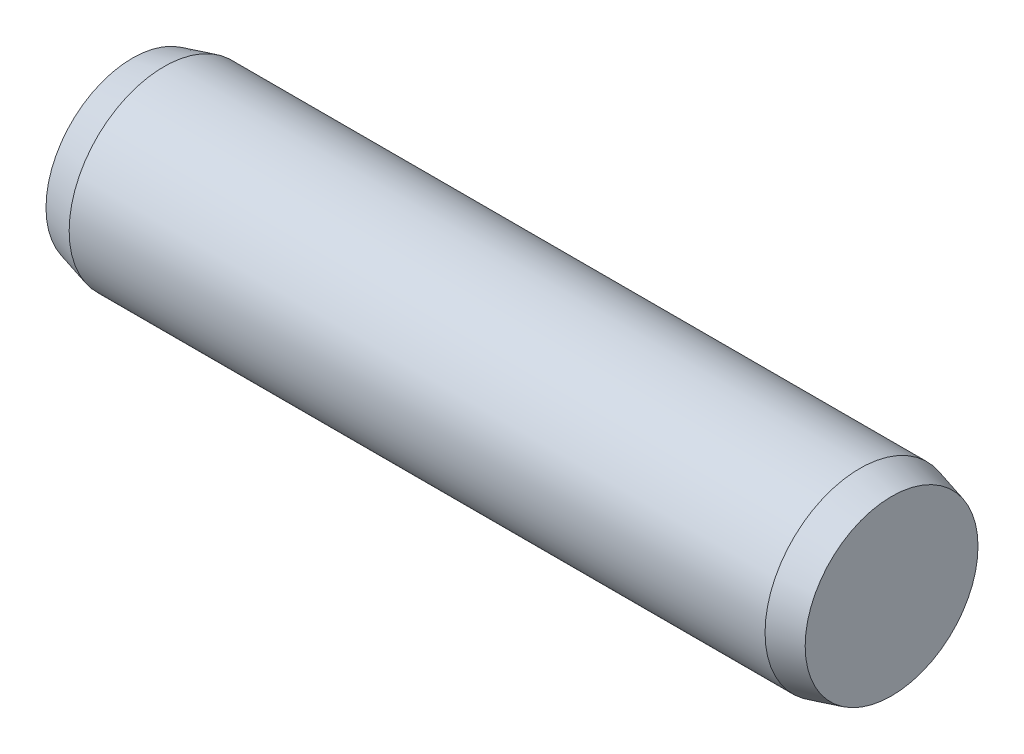
ISO-10303-21;
HEADER;
FILE_DESCRIPTION(('STEP AP214'),'2;1');
FILE_NAME('part.step','',(''),(''),'','','');
FILE_SCHEMA(('AUTOMOTIVE_DESIGN { 1 0 10303 214 1 1 1 1 }'));
ENDSEC;
DATA;
#1=APPLICATION_CONTEXT('core data for automotive mechanical design processes');
#2=APPLICATION_PROTOCOL_DEFINITION('international standard','automotive_design',2000,#1);
#3=PRODUCT_CONTEXT('',#1,'mechanical');
#4=PRODUCT('Part','Part','',(#3));
#5=PRODUCT_RELATED_PRODUCT_CATEGORY('part','',(#4));
#6=PRODUCT_DEFINITION_FORMATION('','',#4);
#7=PRODUCT_DEFINITION_CONTEXT('part definition',#1,'design');
#8=PRODUCT_DEFINITION('design','',#6,#7);
#9=PRODUCT_DEFINITION_SHAPE('','',#8);
#10=(LENGTH_UNIT() NAMED_UNIT(*) SI_UNIT(.MILLI.,.METRE.));
#11=(NAMED_UNIT(*) PLANE_ANGLE_UNIT() SI_UNIT($,.RADIAN.));
#12=(NAMED_UNIT(*) SI_UNIT($,.STERADIAN.) SOLID_ANGLE_UNIT());
#13=UNCERTAINTY_MEASURE_WITH_UNIT(LENGTH_MEASURE(1.E-05),#10,'distance_accuracy_value','');
#14=(GEOMETRIC_REPRESENTATION_CONTEXT(3) GLOBAL_UNCERTAINTY_ASSIGNED_CONTEXT((#13)) GLOBAL_UNIT_ASSIGNED_CONTEXT((#10,
#11,#12)) REPRESENTATION_CONTEXT('',''));
#15=CARTESIAN_POINT('',(0.,0.,0.));
#16=DIRECTION('',(0.,0.,1.));
#17=DIRECTION('',(1.,0.,0.));
#18=AXIS2_PLACEMENT_3D('',#15,#16,#17);
#19=CARTESIAN_POINT('',(-6.,0.,0.));
#20=DIRECTION('',(-1.,0.,0.));
#21=DIRECTION('',(0.,0.,1.));
#22=AXIS2_PLACEMENT_3D('',#19,#20,#21);
#23=PLANE('',#22);
#24=CARTESIAN_POINT('',(-5.99999999997181,0.,0.));
#25=DIRECTION('',(1.,0.,0.));
#26=DIRECTION('',(0.,0.,-1.));
#27=AXIS2_PLACEMENT_3D('',#24,#25,#26);
#28=CIRCLE('',#27,1.36602540379931);
#29=CARTESIAN_POINT('',(-5.99999999997181,0.,-1.36602540379931));
#30=VERTEX_POINT('',#29);
#31=EDGE_CURVE('E18',#30,#30,#28,.T.);
#32=ORIENTED_EDGE('',*,*,#31,.F.);
#33=EDGE_LOOP('',(#32));
#34=FACE_BOUND('',#33,.T.);
#35=ADVANCED_FACE('F15',(#34),#23,.T.);
#36=CARTESIAN_POINT('',(6.,0.,0.));
#37=DIRECTION('',(1.,0.,0.));
#38=DIRECTION('',(0.,0.,-1.));
#39=AXIS2_PLACEMENT_3D('',#36,#37,#38);
#40=PLANE('',#39);
#41=CARTESIAN_POINT('',(5.99999999997181,0.,0.));
#42=DIRECTION('',(-1.,0.,0.));
#43=DIRECTION('',(0.,0.,1.));
#44=AXIS2_PLACEMENT_3D('',#41,#42,#43);
#45=CIRCLE('',#44,1.36602540379931);
#46=CARTESIAN_POINT('',(5.99999999997181,0.,1.36602540379931));
#47=VERTEX_POINT('',#46);
#48=EDGE_CURVE('E27',#47,#47,#45,.T.);
#49=ORIENTED_EDGE('',*,*,#48,.F.);
#50=EDGE_LOOP('',(#49));
#51=FACE_BOUND('',#50,.T.);
#52=ADVANCED_FACE('F39',(#51),#40,.T.);
#53=CARTESIAN_POINT('',(-5.50000000015416,0.,0.));
#54=DIRECTION('',(1.,0.,0.));
#55=DIRECTION('',(0.,0.,-1.));
#56=AXIS2_PLACEMENT_3D('',#53,#54,#55);
#57=CONICAL_SURFACE('',#56,1.49999999996453,0.261799387796393);
#58=ORIENTED_EDGE('',*,*,#31,.T.);
#59=EDGE_LOOP('',(#58));
#60=FACE_BOUND('',#59,.T.);
#61=CARTESIAN_POINT('',(-5.5,0.,0.));
#62=DIRECTION('',(1.,0.,0.));
#63=DIRECTION('',(0.,0.,-1.));
#64=AXIS2_PLACEMENT_3D('',#61,#62,#63);
#65=CIRCLE('',#64,1.5);
#66=CARTESIAN_POINT('',(-5.5,0.,-1.5));
#67=VERTEX_POINT('',#66);
#68=EDGE_CURVE('E22',#67,#67,#65,.T.);
#69=ORIENTED_EDGE('',*,*,#68,.F.);
#70=EDGE_LOOP('',(#69));
#71=FACE_BOUND('',#70,.T.);
#72=ADVANCED_FACE('F35',(#60,#71),#57,.T.);
#73=CARTESIAN_POINT('',(5.50000000015416,0.,0.));
#74=DIRECTION('',(-1.,0.,0.));
#75=DIRECTION('',(0.,0.,1.));
#76=AXIS2_PLACEMENT_3D('',#73,#74,#75);
#77=CONICAL_SURFACE('',#76,1.49999999996453,0.261799387796393);
#78=ORIENTED_EDGE('',*,*,#48,.T.);
#79=EDGE_LOOP('',(#78));
#80=FACE_BOUND('',#79,.T.);
#81=CARTESIAN_POINT('',(5.5,0.,0.));
#82=DIRECTION('',(1.,0.,0.));
#83=DIRECTION('',(0.,0.,-1.));
#84=AXIS2_PLACEMENT_3D('',#81,#82,#83);
#85=CIRCLE('',#84,1.5);
#86=CARTESIAN_POINT('',(5.5,0.,-1.5));
#87=VERTEX_POINT('',#86);
#88=EDGE_CURVE('E10',#87,#87,#85,.F.);
#89=ORIENTED_EDGE('',*,*,#88,.F.);
#90=EDGE_LOOP('',(#89));
#91=FACE_BOUND('',#90,.T.);
#92=ADVANCED_FACE('F47',(#80,#91),#77,.T.);
#93=CARTESIAN_POINT('',(-5.5,0.,0.));
#94=DIRECTION('',(1.,0.,0.));
#95=DIRECTION('',(0.,0.,-1.));
#96=AXIS2_PLACEMENT_3D('',#93,#94,#95);
#97=CYLINDRICAL_SURFACE('',#96,1.5);
#98=ORIENTED_EDGE('',*,*,#88,.T.);
#99=EDGE_LOOP('',(#98));
#100=FACE_BOUND('',#99,.T.);
#101=ORIENTED_EDGE('',*,*,#68,.T.);
#102=EDGE_LOOP('',(#101));
#103=FACE_BOUND('',#102,.T.);
#104=ADVANCED_FACE('F45',(#100,#103),#97,.T.);
#105=CLOSED_SHELL('',(#35,#52,#72,#92,#104));
#106=MANIFOLD_SOLID_BREP('B1',#105);
#107=ADVANCED_BREP_SHAPE_REPRESENTATION('',(#18,#106),#14);
#108=SHAPE_DEFINITION_REPRESENTATION(#9,#107);
ENDSEC;
END-ISO-10303-21;
